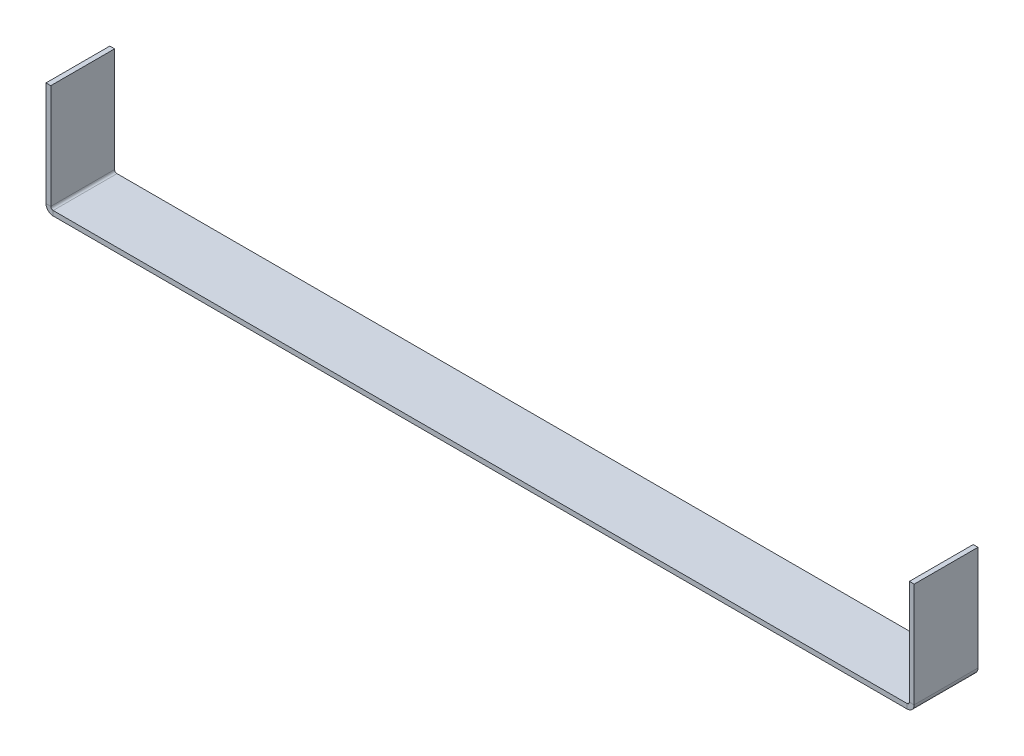
ISO-10303-21;
HEADER;
FILE_DESCRIPTION(('STEP AP214'),'2;1');
FILE_NAME('part.step','',(''),(''),'','','');
FILE_SCHEMA(('AUTOMOTIVE_DESIGN { 1 0 10303 214 1 1 1 1 }'));
ENDSEC;
DATA;
#1=APPLICATION_CONTEXT('core data for automotive mechanical design processes');
#2=APPLICATION_PROTOCOL_DEFINITION('international standard','automotive_design',2000,#1);
#3=PRODUCT_CONTEXT('',#1,'mechanical');
#4=PRODUCT('Part','Part','',(#3));
#5=PRODUCT_RELATED_PRODUCT_CATEGORY('part','',(#4));
#6=PRODUCT_DEFINITION_FORMATION('','',#4);
#7=PRODUCT_DEFINITION_CONTEXT('part definition',#1,'design');
#8=PRODUCT_DEFINITION('design','',#6,#7);
#9=PRODUCT_DEFINITION_SHAPE('','',#8);
#10=(LENGTH_UNIT() NAMED_UNIT(*) SI_UNIT(.MILLI.,.METRE.));
#11=(NAMED_UNIT(*) PLANE_ANGLE_UNIT() SI_UNIT($,.RADIAN.));
#12=(NAMED_UNIT(*) SI_UNIT($,.STERADIAN.) SOLID_ANGLE_UNIT());
#13=UNCERTAINTY_MEASURE_WITH_UNIT(LENGTH_MEASURE(1.E-05),#10,'distance_accuracy_value','');
#14=(GEOMETRIC_REPRESENTATION_CONTEXT(3) GLOBAL_UNCERTAINTY_ASSIGNED_CONTEXT((#13)) GLOBAL_UNIT_ASSIGNED_CONTEXT((#10,
#11,#12)) REPRESENTATION_CONTEXT('',''));
#15=CARTESIAN_POINT('',(0.,0.,0.));
#16=DIRECTION('',(0.,0.,1.));
#17=DIRECTION('',(1.,0.,0.));
#18=AXIS2_PLACEMENT_3D('',#15,#16,#17);
#19=CARTESIAN_POINT('',(0.,-1.5,0.));
#20=DIRECTION('',(0.,-1.,0.));
#21=DIRECTION('',(0.,0.,-1.));
#22=AXIS2_PLACEMENT_3D('',#19,#20,#21);
#23=PLANE('',#22);
#24=DIRECTION('',(-1.,0.,0.));
#25=VECTOR('',#24,1.);
#26=CARTESIAN_POINT('',(0.,-1.5,-20.));
#27=LINE('',#26,#25);
#28=CARTESIAN_POINT('',(269.7634,-1.5,-20.));
#29=VERTEX_POINT('',#28);
#30=CARTESIAN_POINT('',(2.2366,-1.5,-20.));
#31=VERTEX_POINT('',#30);
#32=EDGE_CURVE('E13',#29,#31,#27,.T.);
#33=ORIENTED_EDGE('',*,*,#32,.F.);
#34=DIRECTION('',(0.,0.,-1.));
#35=VECTOR('',#34,1.);
#36=CARTESIAN_POINT('',(269.7634,-1.5,-20.));
#37=LINE('',#36,#35);
#38=CARTESIAN_POINT('',(269.7634,-1.5,0.));
#39=VERTEX_POINT('',#38);
#40=EDGE_CURVE('E327',#29,#39,#37,.F.);
#41=ORIENTED_EDGE('',*,*,#40,.T.);
#42=DIRECTION('',(1.,0.,0.));
#43=VECTOR('',#42,1.);
#44=CARTESIAN_POINT('',(0.,-1.5,0.));
#45=LINE('',#44,#43);
#46=CARTESIAN_POINT('',(2.2366,-1.5,0.));
#47=VERTEX_POINT('',#46);
#48=EDGE_CURVE('E88',#47,#39,#45,.T.);
#49=ORIENTED_EDGE('',*,*,#48,.F.);
#50=DIRECTION('',(0.,0.,1.));
#51=VECTOR('',#50,1.);
#52=CARTESIAN_POINT('',(2.2366,-1.5,0.));
#53=LINE('',#52,#51);
#54=EDGE_CURVE('E102',#47,#31,#53,.F.);
#55=ORIENTED_EDGE('',*,*,#54,.T.);
#56=EDGE_LOOP('',(#33,#41,#49,#55));
#57=FACE_BOUND('',#56,.T.);
#58=ADVANCED_FACE('F79',(#57),#23,.T.);
#59=CARTESIAN_POINT('',(0.,0.,0.));
#60=DIRECTION('',(0.,-1.,0.));
#61=DIRECTION('',(0.,0.,-1.));
#62=AXIS2_PLACEMENT_3D('',#59,#60,#61);
#63=PLANE('',#62);
#64=DIRECTION('',(0.,0.,-1.));
#65=VECTOR('',#64,1.);
#66=CARTESIAN_POINT('',(269.7634,0.,-20.));
#67=LINE('',#66,#65);
#68=CARTESIAN_POINT('',(269.7634,0.,-20.));
#69=VERTEX_POINT('',#68);
#70=CARTESIAN_POINT('',(269.7634,0.,0.));
#71=VERTEX_POINT('',#70);
#72=EDGE_CURVE('E199',#69,#71,#67,.F.);
#73=ORIENTED_EDGE('',*,*,#72,.F.);
#74=DIRECTION('',(-1.,0.,0.));
#75=VECTOR('',#74,1.);
#76=CARTESIAN_POINT('',(0.,0.,-20.));
#77=LINE('',#76,#75);
#78=CARTESIAN_POINT('',(2.2366,0.,-20.));
#79=VERTEX_POINT('',#78);
#80=EDGE_CURVE('E83',#69,#79,#77,.T.);
#81=ORIENTED_EDGE('',*,*,#80,.T.);
#82=DIRECTION('',(0.,0.,1.));
#83=VECTOR('',#82,1.);
#84=CARTESIAN_POINT('',(2.2366,0.,0.));
#85=LINE('',#84,#83);
#86=CARTESIAN_POINT('',(2.2366,0.,0.));
#87=VERTEX_POINT('',#86);
#88=EDGE_CURVE('E146',#87,#79,#85,.F.);
#89=ORIENTED_EDGE('',*,*,#88,.F.);
#90=DIRECTION('',(1.,0.,0.));
#91=VECTOR('',#90,1.);
#92=CARTESIAN_POINT('',(0.,0.,0.));
#93=LINE('',#92,#91);
#94=EDGE_CURVE('E187',#87,#71,#93,.T.);
#95=ORIENTED_EDGE('',*,*,#94,.T.);
#96=EDGE_LOOP('',(#73,#81,#89,#95));
#97=FACE_BOUND('',#96,.T.);
#98=ADVANCED_FACE('F196',(#97),#63,.F.);
#99=CARTESIAN_POINT('',(0.,-1.5,-20.));
#100=DIRECTION('',(0.,0.,-1.));
#101=DIRECTION('',(-1.,0.,0.));
#102=AXIS2_PLACEMENT_3D('',#99,#100,#101);
#103=PLANE('',#102);
#104=ORIENTED_EDGE('',*,*,#80,.F.);
#105=DIRECTION('',(0.,-1.,0.));
#106=VECTOR('',#105,1.);
#107=CARTESIAN_POINT('',(269.7634,0.,-20.));
#108=LINE('',#107,#106);
#109=EDGE_CURVE('E333',#69,#29,#108,.T.);
#110=ORIENTED_EDGE('',*,*,#109,.T.);
#111=ORIENTED_EDGE('',*,*,#32,.T.);
#112=DIRECTION('',(0.,-1.,0.));
#113=VECTOR('',#112,1.);
#114=CARTESIAN_POINT('',(2.2366,0.,-20.));
#115=LINE('',#114,#113);
#116=EDGE_CURVE('E184',#79,#31,#115,.T.);
#117=ORIENTED_EDGE('',*,*,#116,.F.);
#118=EDGE_LOOP('',(#104,#110,#111,#117));
#119=FACE_BOUND('',#118,.T.);
#120=ADVANCED_FACE('F202',(#119),#103,.T.);
#121=CARTESIAN_POINT('',(0.,-1.5,0.));
#122=DIRECTION('',(0.,0.,1.));
#123=DIRECTION('',(1.,0.,0.));
#124=AXIS2_PLACEMENT_3D('',#121,#122,#123);
#125=PLANE('',#124);
#126=DIRECTION('',(0.,-1.,0.));
#127=VECTOR('',#126,1.);
#128=CARTESIAN_POINT('',(269.7634,0.,0.));
#129=LINE('',#128,#127);
#130=EDGE_CURVE('E175',#71,#39,#129,.T.);
#131=ORIENTED_EDGE('',*,*,#130,.F.);
#132=ORIENTED_EDGE('',*,*,#94,.F.);
#133=DIRECTION('',(0.,-1.,0.));
#134=VECTOR('',#133,1.);
#135=CARTESIAN_POINT('',(2.2366,0.,0.));
#136=LINE('',#135,#134);
#137=EDGE_CURVE('E145',#87,#47,#136,.T.);
#138=ORIENTED_EDGE('',*,*,#137,.T.);
#139=ORIENTED_EDGE('',*,*,#48,.T.);
#140=EDGE_LOOP('',(#131,#132,#138,#139));
#141=FACE_BOUND('',#140,.T.);
#142=ADVANCED_FACE('F81',(#141),#125,.T.);
#143=CARTESIAN_POINT('',(2.2366,0.7366,-20.));
#144=DIRECTION('',(0.,0.,-1.));
#145=DIRECTION('',(-1.,0.,0.));
#146=AXIS2_PLACEMENT_3D('',#143,#144,#145);
#147=PLANE('',#146);
#148=DIRECTION('',(1.,0.,0.));
#149=VECTOR('',#148,1.);
#150=CARTESIAN_POINT('',(0.,0.736599999999992,-20.));
#151=LINE('',#150,#149);
#152=CARTESIAN_POINT('',(1.5,0.736599999999997,-20.));
#153=VERTEX_POINT('',#152);
#154=CARTESIAN_POINT('',(0.,0.736599999999992,-20.));
#155=VERTEX_POINT('',#154);
#156=EDGE_CURVE('E136',#153,#155,#151,.F.);
#157=ORIENTED_EDGE('',*,*,#156,.F.);
#158=CARTESIAN_POINT('',(2.2366,0.7366,-20.));
#159=DIRECTION('',(0.,0.,1.));
#160=DIRECTION('',(1.,0.,0.));
#161=AXIS2_PLACEMENT_3D('',#158,#159,#160);
#162=CIRCLE('',#161,0.7366);
#163=EDGE_CURVE('E130',#79,#153,#162,.F.);
#164=ORIENTED_EDGE('',*,*,#163,.F.);
#165=ORIENTED_EDGE('',*,*,#116,.T.);
#166=CARTESIAN_POINT('',(2.2366,0.7366,-20.));
#167=DIRECTION('',(0.,0.,1.));
#168=DIRECTION('',(1.,0.,0.));
#169=AXIS2_PLACEMENT_3D('',#166,#167,#168);
#170=CIRCLE('',#169,2.2366);
#171=EDGE_CURVE('E177',#31,#155,#170,.F.);
#172=ORIENTED_EDGE('',*,*,#171,.T.);
#173=EDGE_LOOP('',(#157,#164,#165,#172));
#174=FACE_BOUND('',#173,.T.);
#175=ADVANCED_FACE('F201',(#174),#147,.T.);
#176=CARTESIAN_POINT('',(2.2366,0.7366,0.));
#177=DIRECTION('',(0.,0.,-1.));
#178=DIRECTION('',(-1.,0.,0.));
#179=AXIS2_PLACEMENT_3D('',#176,#177,#178);
#180=PLANE('',#179);
#181=CARTESIAN_POINT('',(2.2366,0.7366,0.));
#182=DIRECTION('',(0.,0.,1.));
#183=DIRECTION('',(1.,0.,0.));
#184=AXIS2_PLACEMENT_3D('',#181,#182,#183);
#185=CIRCLE('',#184,0.7366);
#186=CARTESIAN_POINT('',(1.5,0.736599999999997,0.));
#187=VERTEX_POINT('',#186);
#188=EDGE_CURVE('E127',#187,#87,#185,.T.);
#189=ORIENTED_EDGE('',*,*,#188,.F.);
#190=DIRECTION('',(1.,0.,0.));
#191=VECTOR('',#190,1.);
#192=CARTESIAN_POINT('',(1.5,0.736599999999997,0.));
#193=LINE('',#192,#191);
#194=CARTESIAN_POINT('',(0.,0.736599999999992,0.));
#195=VERTEX_POINT('',#194);
#196=EDGE_CURVE('E135',#187,#195,#193,.F.);
#197=ORIENTED_EDGE('',*,*,#196,.T.);
#198=CARTESIAN_POINT('',(2.2366,0.7366,0.));
#199=DIRECTION('',(0.,0.,1.));
#200=DIRECTION('',(1.,0.,0.));
#201=AXIS2_PLACEMENT_3D('',#198,#199,#200);
#202=CIRCLE('',#201,2.2366);
#203=EDGE_CURVE('E178',#195,#47,#202,.T.);
#204=ORIENTED_EDGE('',*,*,#203,.T.);
#205=ORIENTED_EDGE('',*,*,#137,.F.);
#206=EDGE_LOOP('',(#189,#197,#204,#205));
#207=FACE_BOUND('',#206,.T.);
#208=ADVANCED_FACE('F141',(#207),#180,.F.);
#209=CARTESIAN_POINT('',(2.2366,0.7366,0.));
#210=DIRECTION('',(0.,0.,1.));
#211=DIRECTION('',(-1.,0.,0.));
#212=AXIS2_PLACEMENT_3D('',#209,#210,#211);
#213=CYLINDRICAL_SURFACE('',#212,2.2366);
#214=ORIENTED_EDGE('',*,*,#54,.F.);
#215=ORIENTED_EDGE('',*,*,#203,.F.);
#216=DIRECTION('',(0.,0.,1.));
#217=VECTOR('',#216,1.);
#218=CARTESIAN_POINT('',(0.,0.736599999999992,-20.));
#219=LINE('',#218,#217);
#220=EDGE_CURVE('E159',#195,#155,#219,.F.);
#221=ORIENTED_EDGE('',*,*,#220,.T.);
#222=ORIENTED_EDGE('',*,*,#171,.F.);
#223=EDGE_LOOP('',(#214,#215,#221,#222));
#224=FACE_BOUND('',#223,.T.);
#225=ADVANCED_FACE('F218',(#224),#213,.T.);
#226=CARTESIAN_POINT('',(2.2366,0.7366,0.));
#227=DIRECTION('',(0.,0.,1.));
#228=DIRECTION('',(-1.,0.,0.));
#229=AXIS2_PLACEMENT_3D('',#226,#227,#228);
#230=CYLINDRICAL_SURFACE('',#229,0.7366);
#231=ORIENTED_EDGE('',*,*,#88,.T.);
#232=ORIENTED_EDGE('',*,*,#163,.T.);
#233=DIRECTION('',(0.,0.,1.));
#234=VECTOR('',#233,1.);
#235=CARTESIAN_POINT('',(1.5,0.736599999999997,-20.));
#236=LINE('',#235,#234);
#237=EDGE_CURVE('E123',#153,#187,#236,.T.);
#238=ORIENTED_EDGE('',*,*,#237,.T.);
#239=ORIENTED_EDGE('',*,*,#188,.T.);
#240=EDGE_LOOP('',(#231,#232,#238,#239));
#241=FACE_BOUND('',#240,.T.);
#242=ADVANCED_FACE('F126',(#241),#230,.F.);
#243=CARTESIAN_POINT('',(0.,0.,-20.));
#244=DIRECTION('',(0.,0.,1.));
#245=DIRECTION('',(1.,0.,0.));
#246=AXIS2_PLACEMENT_3D('',#243,#244,#245);
#247=PLANE('',#246);
#248=ORIENTED_EDGE('',*,*,#156,.T.);
#249=DIRECTION('',(0.,-1.,0.));
#250=VECTOR('',#249,1.);
#251=CARTESIAN_POINT('',(0.,0.,-20.));
#252=LINE('',#251,#250);
#253=CARTESIAN_POINT('',(-1.16964624851245E-13,33.5,-20.));
#254=VERTEX_POINT('',#253);
#255=EDGE_CURVE('E167',#254,#155,#252,.T.);
#256=ORIENTED_EDGE('',*,*,#255,.F.);
#257=DIRECTION('',(1.,0.,0.));
#258=VECTOR('',#257,1.);
#259=CARTESIAN_POINT('',(-1.16964624851245E-13,33.5,-20.));
#260=LINE('',#259,#258);
#261=CARTESIAN_POINT('',(1.49999999999988,33.5,-20.));
#262=VERTEX_POINT('',#261);
#263=EDGE_CURVE('E347',#254,#262,#260,.T.);
#264=ORIENTED_EDGE('',*,*,#263,.T.);
#265=DIRECTION('',(0.,1.,0.));
#266=VECTOR('',#265,1.);
#267=CARTESIAN_POINT('',(1.5,0.,-20.));
#268=LINE('',#267,#266);
#269=EDGE_CURVE('E165',#262,#153,#268,.F.);
#270=ORIENTED_EDGE('',*,*,#269,.T.);
#271=EDGE_LOOP('',(#248,#256,#264,#270));
#272=FACE_BOUND('',#271,.T.);
#273=ADVANCED_FACE('F223',(#272),#247,.F.);
#274=CARTESIAN_POINT('',(-1.16876994193937E-13,33.5,0.));
#275=DIRECTION('',(0.,0.,-1.));
#276=DIRECTION('',(-1.,0.,0.));
#277=AXIS2_PLACEMENT_3D('',#274,#275,#276);
#278=PLANE('',#277);
#279=ORIENTED_EDGE('',*,*,#196,.F.);
#280=DIRECTION('',(0.,-1.,0.));
#281=VECTOR('',#280,1.);
#282=CARTESIAN_POINT('',(1.49999999999988,33.5,0.));
#283=LINE('',#282,#281);
#284=CARTESIAN_POINT('',(1.49999999999988,33.5,0.));
#285=VERTEX_POINT('',#284);
#286=EDGE_CURVE('E155',#187,#285,#283,.F.);
#287=ORIENTED_EDGE('',*,*,#286,.T.);
#288=DIRECTION('',(1.,0.,0.));
#289=VECTOR('',#288,1.);
#290=CARTESIAN_POINT('',(-1.16876994193937E-13,33.5,0.));
#291=LINE('',#290,#289);
#292=CARTESIAN_POINT('',(-1.16964624851245E-13,33.5,0.));
#293=VERTEX_POINT('',#292);
#294=EDGE_CURVE('E147',#293,#285,#291,.T.);
#295=ORIENTED_EDGE('',*,*,#294,.F.);
#296=DIRECTION('',(0.,1.,0.));
#297=VECTOR('',#296,1.);
#298=CARTESIAN_POINT('',(0.,0.,0.));
#299=LINE('',#298,#297);
#300=EDGE_CURVE('E158',#195,#293,#299,.T.);
#301=ORIENTED_EDGE('',*,*,#300,.F.);
#302=EDGE_LOOP('',(#279,#287,#295,#301));
#303=FACE_BOUND('',#302,.T.);
#304=ADVANCED_FACE('F152',(#303),#278,.F.);
#305=CARTESIAN_POINT('',(0.,0.,0.));
#306=DIRECTION('',(1.,0.,0.));
#307=DIRECTION('',(0.,1.,0.));
#308=AXIS2_PLACEMENT_3D('',#305,#306,#307);
#309=PLANE('',#308);
#310=ORIENTED_EDGE('',*,*,#220,.F.);
#311=ORIENTED_EDGE('',*,*,#300,.T.);
#312=DIRECTION('',(0.,0.,-1.));
#313=VECTOR('',#312,1.);
#314=CARTESIAN_POINT('',(-1.16964624851245E-13,33.5,0.));
#315=LINE('',#314,#313);
#316=EDGE_CURVE('E350',#293,#254,#315,.T.);
#317=ORIENTED_EDGE('',*,*,#316,.T.);
#318=ORIENTED_EDGE('',*,*,#255,.T.);
#319=EDGE_LOOP('',(#310,#311,#317,#318));
#320=FACE_BOUND('',#319,.T.);
#321=ADVANCED_FACE('F231',(#320),#309,.F.);
#322=CARTESIAN_POINT('',(1.5,0.,0.));
#323=DIRECTION('',(1.,0.,0.));
#324=DIRECTION('',(0.,1.,0.));
#325=AXIS2_PLACEMENT_3D('',#322,#323,#324);
#326=PLANE('',#325);
#327=ORIENTED_EDGE('',*,*,#286,.F.);
#328=ORIENTED_EDGE('',*,*,#237,.F.);
#329=ORIENTED_EDGE('',*,*,#269,.F.);
#330=DIRECTION('',(0.,0.,1.));
#331=VECTOR('',#330,1.);
#332=CARTESIAN_POINT('',(1.49999999999988,33.5,-20.));
#333=LINE('',#332,#331);
#334=EDGE_CURVE('E164',#285,#262,#333,.F.);
#335=ORIENTED_EDGE('',*,*,#334,.F.);
#336=EDGE_LOOP('',(#327,#328,#329,#335));
#337=FACE_BOUND('',#336,.T.);
#338=ADVANCED_FACE('F162',(#337),#326,.T.);
#339=CARTESIAN_POINT('',(-1.16876994193937E-13,33.5,-20.));
#340=DIRECTION('',(0.,-1.,0.));
#341=DIRECTION('',(1.,0.,0.));
#342=AXIS2_PLACEMENT_3D('',#339,#340,#341);
#343=PLANE('',#342);
#344=ORIENTED_EDGE('',*,*,#334,.T.);
#345=ORIENTED_EDGE('',*,*,#263,.F.);
#346=ORIENTED_EDGE('',*,*,#316,.F.);
#347=ORIENTED_EDGE('',*,*,#294,.T.);
#348=EDGE_LOOP('',(#344,#345,#346,#347));
#349=FACE_BOUND('',#348,.T.);
#350=ADVANCED_FACE('F232',(#349),#343,.F.);
#351=CARTESIAN_POINT('',(269.7634,0.736599999999979,0.));
#352=DIRECTION('',(0.,0.,1.));
#353=DIRECTION('',(1.,0.,0.));
#354=AXIS2_PLACEMENT_3D('',#351,#352,#353);
#355=PLANE('',#354);
#356=DIRECTION('',(-1.,0.,0.));
#357=VECTOR('',#356,1.);
#358=CARTESIAN_POINT('',(272.,0.736599999999971,0.));
#359=LINE('',#358,#357);
#360=CARTESIAN_POINT('',(270.5,0.736599999999976,0.));
#361=VERTEX_POINT('',#360);
#362=CARTESIAN_POINT('',(272.,0.736599999999971,0.));
#363=VERTEX_POINT('',#362);
#364=EDGE_CURVE('E324',#361,#363,#359,.F.);
#365=ORIENTED_EDGE('',*,*,#364,.F.);
#366=CARTESIAN_POINT('',(269.7634,0.736599999999979,0.));
#367=DIRECTION('',(0.,0.,-1.));
#368=DIRECTION('',(-1.,0.,0.));
#369=AXIS2_PLACEMENT_3D('',#366,#367,#368);
#370=CIRCLE('',#369,0.736599999999976);
#371=EDGE_CURVE('E336',#71,#361,#370,.F.);
#372=ORIENTED_EDGE('',*,*,#371,.F.);
#373=ORIENTED_EDGE('',*,*,#130,.T.);
#374=CARTESIAN_POINT('',(269.7634,0.736599999999979,0.));
#375=DIRECTION('',(0.,0.,-1.));
#376=DIRECTION('',(-1.,0.,0.));
#377=AXIS2_PLACEMENT_3D('',#374,#375,#376);
#378=CIRCLE('',#377,2.23659999999998);
#379=EDGE_CURVE('E330',#39,#363,#378,.F.);
#380=ORIENTED_EDGE('',*,*,#379,.T.);
#381=EDGE_LOOP('',(#365,#372,#373,#380));
#382=FACE_BOUND('',#381,.T.);
#383=ADVANCED_FACE('F235',(#382),#355,.T.);
#384=CARTESIAN_POINT('',(269.7634,0.736599999999979,-20.));
#385=DIRECTION('',(0.,0.,1.));
#386=DIRECTION('',(1.,0.,0.));
#387=AXIS2_PLACEMENT_3D('',#384,#385,#386);
#388=PLANE('',#387);
#389=CARTESIAN_POINT('',(269.7634,0.736599999999979,-20.));
#390=DIRECTION('',(0.,0.,-1.));
#391=DIRECTION('',(-1.,0.,0.));
#392=AXIS2_PLACEMENT_3D('',#389,#390,#391);
#393=CIRCLE('',#392,0.736599999999976);
#394=CARTESIAN_POINT('',(270.5,0.736599999999976,-20.));
#395=VERTEX_POINT('',#394);
#396=EDGE_CURVE('E340',#395,#69,#393,.T.);
#397=ORIENTED_EDGE('',*,*,#396,.F.);
#398=DIRECTION('',(-1.,0.,0.));
#399=VECTOR('',#398,1.);
#400=CARTESIAN_POINT('',(270.5,0.736599999999976,-20.));
#401=LINE('',#400,#399);
#402=CARTESIAN_POINT('',(272.,0.736599999999971,-20.));
#403=VERTEX_POINT('',#402);
#404=EDGE_CURVE('E298',#395,#403,#401,.F.);
#405=ORIENTED_EDGE('',*,*,#404,.T.);
#406=CARTESIAN_POINT('',(269.7634,0.736599999999979,-20.));
#407=DIRECTION('',(0.,0.,-1.));
#408=DIRECTION('',(-1.,0.,0.));
#409=AXIS2_PLACEMENT_3D('',#406,#407,#408);
#410=CIRCLE('',#409,2.23659999999998);
#411=EDGE_CURVE('E331',#403,#29,#410,.T.);
#412=ORIENTED_EDGE('',*,*,#411,.T.);
#413=ORIENTED_EDGE('',*,*,#109,.F.);
#414=EDGE_LOOP('',(#397,#405,#412,#413));
#415=FACE_BOUND('',#414,.T.);
#416=ADVANCED_FACE('F242',(#415),#388,.F.);
#417=CARTESIAN_POINT('',(269.7634,0.736599999999979,-20.));
#418=DIRECTION('',(0.,0.,-1.));
#419=DIRECTION('',(1.,0.,0.));
#420=AXIS2_PLACEMENT_3D('',#417,#418,#419);
#421=CYLINDRICAL_SURFACE('',#420,2.23659999999998);
#422=ORIENTED_EDGE('',*,*,#40,.F.);
#423=ORIENTED_EDGE('',*,*,#411,.F.);
#424=DIRECTION('',(0.,0.,-1.));
#425=VECTOR('',#424,1.);
#426=CARTESIAN_POINT('',(272.,0.736599999999971,0.));
#427=LINE('',#426,#425);
#428=EDGE_CURVE('E283',#403,#363,#427,.F.);
#429=ORIENTED_EDGE('',*,*,#428,.T.);
#430=ORIENTED_EDGE('',*,*,#379,.F.);
#431=EDGE_LOOP('',(#422,#423,#429,#430));
#432=FACE_BOUND('',#431,.T.);
#433=ADVANCED_FACE('F245',(#432),#421,.T.);
#434=CARTESIAN_POINT('',(269.7634,0.736599999999979,-20.));
#435=DIRECTION('',(0.,0.,-1.));
#436=DIRECTION('',(1.,0.,0.));
#437=AXIS2_PLACEMENT_3D('',#434,#435,#436);
#438=CYLINDRICAL_SURFACE('',#437,0.736599999999976);
#439=ORIENTED_EDGE('',*,*,#72,.T.);
#440=ORIENTED_EDGE('',*,*,#371,.T.);
#441=DIRECTION('',(0.,0.,-1.));
#442=VECTOR('',#441,1.);
#443=CARTESIAN_POINT('',(270.5,0.736599999999976,0.));
#444=LINE('',#443,#442);
#445=EDGE_CURVE('E321',#361,#395,#444,.T.);
#446=ORIENTED_EDGE('',*,*,#445,.T.);
#447=ORIENTED_EDGE('',*,*,#396,.T.);
#448=EDGE_LOOP('',(#439,#440,#446,#447));
#449=FACE_BOUND('',#448,.T.);
#450=ADVANCED_FACE('F250',(#449),#438,.F.);
#451=CARTESIAN_POINT('',(272.,33.5,-20.));
#452=DIRECTION('',(0.,0.,1.));
#453=DIRECTION('',(1.,0.,0.));
#454=AXIS2_PLACEMENT_3D('',#451,#452,#453);
#455=PLANE('',#454);
#456=ORIENTED_EDGE('',*,*,#404,.F.);
#457=DIRECTION('',(0.,-1.,0.));
#458=VECTOR('',#457,1.);
#459=CARTESIAN_POINT('',(270.5,33.5,-20.));
#460=LINE('',#459,#458);
#461=CARTESIAN_POINT('',(270.5,33.5,-20.));
#462=VERTEX_POINT('',#461);
#463=EDGE_CURVE('E297',#395,#462,#460,.F.);
#464=ORIENTED_EDGE('',*,*,#463,.T.);
#465=DIRECTION('',(-1.,0.,0.));
#466=VECTOR('',#465,1.);
#467=CARTESIAN_POINT('',(272.,33.5,-20.));
#468=LINE('',#467,#466);
#469=CARTESIAN_POINT('',(272.,33.5,-20.));
#470=VERTEX_POINT('',#469);
#471=EDGE_CURVE('E306',#470,#462,#468,.T.);
#472=ORIENTED_EDGE('',*,*,#471,.F.);
#473=DIRECTION('',(0.,1.,0.));
#474=VECTOR('',#473,1.);
#475=CARTESIAN_POINT('',(272.,-9.06672036032272E-13,-20.));
#476=LINE('',#475,#474);
#477=EDGE_CURVE('E287',#403,#470,#476,.T.);
#478=ORIENTED_EDGE('',*,*,#477,.F.);
#479=EDGE_LOOP('',(#456,#464,#472,#478));
#480=FACE_BOUND('',#479,.T.);
#481=ADVANCED_FACE('F253',(#480),#455,.F.);
#482=CARTESIAN_POINT('',(272.,0.,0.));
#483=DIRECTION('',(0.,0.,-1.));
#484=DIRECTION('',(-1.,0.,0.));
#485=AXIS2_PLACEMENT_3D('',#482,#483,#484);
#486=PLANE('',#485);
#487=ORIENTED_EDGE('',*,*,#364,.T.);
#488=DIRECTION('',(0.,-1.,0.));
#489=VECTOR('',#488,1.);
#490=CARTESIAN_POINT('',(272.,-9.06672036032272E-13,0.));
#491=LINE('',#490,#489);
#492=CARTESIAN_POINT('',(272.,33.5,0.));
#493=VERTEX_POINT('',#492);
#494=EDGE_CURVE('E291',#493,#363,#491,.T.);
#495=ORIENTED_EDGE('',*,*,#494,.F.);
#496=DIRECTION('',(-1.,0.,0.));
#497=VECTOR('',#496,1.);
#498=CARTESIAN_POINT('',(272.,33.5,0.));
#499=LINE('',#498,#497);
#500=CARTESIAN_POINT('',(270.5,33.5,0.));
#501=VERTEX_POINT('',#500);
#502=EDGE_CURVE('E386',#493,#501,#499,.T.);
#503=ORIENTED_EDGE('',*,*,#502,.T.);
#504=DIRECTION('',(0.,1.,0.));
#505=VECTOR('',#504,1.);
#506=CARTESIAN_POINT('',(270.5,0.,0.));
#507=LINE('',#506,#505);
#508=EDGE_CURVE('E309',#501,#361,#507,.F.);
#509=ORIENTED_EDGE('',*,*,#508,.T.);
#510=EDGE_LOOP('',(#487,#495,#503,#509));
#511=FACE_BOUND('',#510,.T.);
#512=ADVANCED_FACE('F260',(#511),#486,.F.);
#513=CARTESIAN_POINT('',(272.,-9.06672036032272E-13,0.));
#514=DIRECTION('',(-1.,0.,0.));
#515=DIRECTION('',(0.,-1.,0.));
#516=AXIS2_PLACEMENT_3D('',#513,#514,#515);
#517=PLANE('',#516);
#518=ORIENTED_EDGE('',*,*,#428,.F.);
#519=ORIENTED_EDGE('',*,*,#477,.T.);
#520=DIRECTION('',(0.,0.,1.));
#521=VECTOR('',#520,1.);
#522=CARTESIAN_POINT('',(272.,33.5,0.));
#523=LINE('',#522,#521);
#524=EDGE_CURVE('E308',#470,#493,#523,.T.);
#525=ORIENTED_EDGE('',*,*,#524,.T.);
#526=ORIENTED_EDGE('',*,*,#494,.T.);
#527=EDGE_LOOP('',(#518,#519,#525,#526));
#528=FACE_BOUND('',#527,.T.);
#529=ADVANCED_FACE('F269',(#528),#517,.F.);
#530=CARTESIAN_POINT('',(270.5,-9.01434814024008E-13,0.));
#531=DIRECTION('',(-1.,0.,0.));
#532=DIRECTION('',(0.,-1.,0.));
#533=AXIS2_PLACEMENT_3D('',#530,#531,#532);
#534=PLANE('',#533);
#535=ORIENTED_EDGE('',*,*,#463,.F.);
#536=ORIENTED_EDGE('',*,*,#445,.F.);
#537=ORIENTED_EDGE('',*,*,#508,.F.);
#538=DIRECTION('',(0.,0.,-1.));
#539=VECTOR('',#538,1.);
#540=CARTESIAN_POINT('',(270.5,33.5,0.));
#541=LINE('',#540,#539);
#542=EDGE_CURVE('E313',#462,#501,#541,.F.);
#543=ORIENTED_EDGE('',*,*,#542,.F.);
#544=EDGE_LOOP('',(#535,#536,#537,#543));
#545=FACE_BOUND('',#544,.T.);
#546=ADVANCED_FACE('F265',(#545),#534,.T.);
#547=CARTESIAN_POINT('',(272.,33.5,0.));
#548=DIRECTION('',(0.,-1.,0.));
#549=DIRECTION('',(1.,0.,0.));
#550=AXIS2_PLACEMENT_3D('',#547,#548,#549);
#551=PLANE('',#550);
#552=ORIENTED_EDGE('',*,*,#542,.T.);
#553=ORIENTED_EDGE('',*,*,#502,.F.);
#554=ORIENTED_EDGE('',*,*,#524,.F.);
#555=ORIENTED_EDGE('',*,*,#471,.T.);
#556=EDGE_LOOP('',(#552,#553,#554,#555));
#557=FACE_BOUND('',#556,.T.);
#558=ADVANCED_FACE('F262',(#557),#551,.F.);
#559=CLOSED_SHELL('',(#58,#98,#120,#142,#175,#208,#225,#242,#273,#304,#321,#338,#350,#383,#416,
#433,#450,#481,#512,#529,#546,#558));
#560=MANIFOLD_SOLID_BREP('B2',#559);
#561=ADVANCED_BREP_SHAPE_REPRESENTATION('',(#18,#560),#14);
#562=SHAPE_DEFINITION_REPRESENTATION(#9,#561);
ENDSEC;
END-ISO-10303-21;
